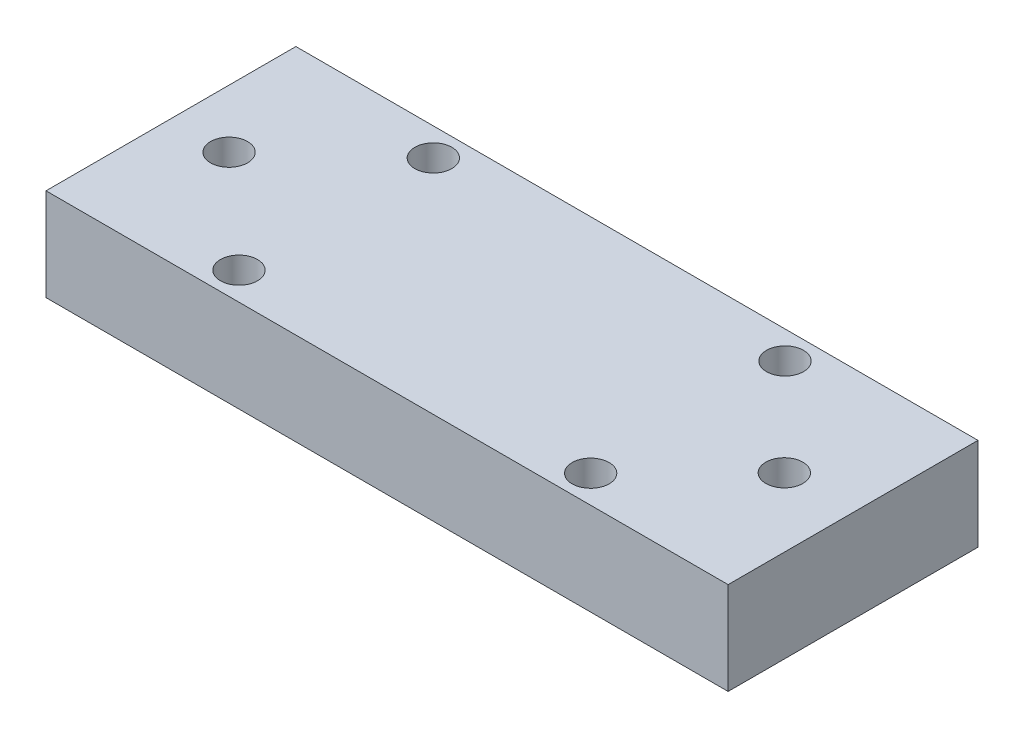
ISO-10303-21;
HEADER;
FILE_DESCRIPTION(('STEP AP214'),'2;1');
FILE_NAME('part.step','',(''),(''),'','','');
FILE_SCHEMA(('AUTOMOTIVE_DESIGN { 1 0 10303 214 1 1 1 1 }'));
ENDSEC;
DATA;
#1=APPLICATION_CONTEXT('core data for automotive mechanical design processes');
#2=APPLICATION_PROTOCOL_DEFINITION('international standard','automotive_design',2000,#1);
#3=PRODUCT_CONTEXT('',#1,'mechanical');
#4=PRODUCT('Part','Part','',(#3));
#5=PRODUCT_RELATED_PRODUCT_CATEGORY('part','',(#4));
#6=PRODUCT_DEFINITION_FORMATION('','',#4);
#7=PRODUCT_DEFINITION_CONTEXT('part definition',#1,'design');
#8=PRODUCT_DEFINITION('design','',#6,#7);
#9=PRODUCT_DEFINITION_SHAPE('','',#8);
#10=(LENGTH_UNIT() NAMED_UNIT(*) SI_UNIT(.MILLI.,.METRE.));
#11=(NAMED_UNIT(*) PLANE_ANGLE_UNIT() SI_UNIT($,.RADIAN.));
#12=(NAMED_UNIT(*) SI_UNIT($,.STERADIAN.) SOLID_ANGLE_UNIT());
#13=UNCERTAINTY_MEASURE_WITH_UNIT(LENGTH_MEASURE(1.E-05),#10,'distance_accuracy_value','');
#14=(GEOMETRIC_REPRESENTATION_CONTEXT(3) GLOBAL_UNCERTAINTY_ASSIGNED_CONTEXT((#13)) GLOBAL_UNIT_ASSIGNED_CONTEXT((#10,
#11,#12)) REPRESENTATION_CONTEXT('',''));
#15=CARTESIAN_POINT('',(0.,0.,0.));
#16=DIRECTION('',(0.,0.,1.));
#17=DIRECTION('',(1.,0.,0.));
#18=AXIS2_PLACEMENT_3D('',#15,#16,#17);
#19=CARTESIAN_POINT('',(0.,5.,0.));
#20=DIRECTION('',(0.,-1.,0.));
#21=DIRECTION('',(0.,0.,-1.));
#22=AXIS2_PLACEMENT_3D('',#19,#20,#21);
#23=PLANE('',#22);
#24=DIRECTION('',(-1.,0.,0.));
#25=VECTOR('',#24,1.);
#26=CARTESIAN_POINT('',(18.4264122816911,5.,-6.75));
#27=LINE('',#26,#25);
#28=CARTESIAN_POINT('',(18.4264122816911,5.,-6.75));
#29=VERTEX_POINT('',#28);
#30=CARTESIAN_POINT('',(-18.4264122816911,5.,-6.75));
#31=VERTEX_POINT('',#30);
#32=EDGE_CURVE('E167',#29,#31,#27,.T.);
#33=ORIENTED_EDGE('',*,*,#32,.T.);
#34=DIRECTION('',(0.,0.,-1.));
#35=VECTOR('',#34,1.);
#36=CARTESIAN_POINT('',(-18.4264122816911,5.,6.75));
#37=LINE('',#36,#35);
#38=CARTESIAN_POINT('',(-18.4264122816911,5.,6.75));
#39=VERTEX_POINT('',#38);
#40=EDGE_CURVE('E174',#39,#31,#37,.T.);
#41=ORIENTED_EDGE('',*,*,#40,.F.);
#42=DIRECTION('',(-1.,0.,0.));
#43=VECTOR('',#42,1.);
#44=CARTESIAN_POINT('',(18.4264122816911,5.,6.74999999999999));
#45=LINE('',#44,#43);
#46=CARTESIAN_POINT('',(18.4264122816911,5.,6.74999999999999));
#47=VERTEX_POINT('',#46);
#48=EDGE_CURVE('E182',#47,#39,#45,.T.);
#49=ORIENTED_EDGE('',*,*,#48,.F.);
#50=DIRECTION('',(0.,0.,-1.));
#51=VECTOR('',#50,1.);
#52=CARTESIAN_POINT('',(18.4264122816911,5.,6.74999999999999));
#53=LINE('',#52,#51);
#54=EDGE_CURVE('E144',#47,#29,#53,.T.);
#55=ORIENTED_EDGE('',*,*,#54,.T.);
#56=EDGE_LOOP('',(#33,#41,#49,#55));
#57=FACE_BOUND('',#56,.T.);
#58=CARTESIAN_POINT('',(-15.2864849599533,5.,0.));
#59=DIRECTION('',(0.,1.,0.));
#60=DIRECTION('',(0.,0.,1.));
#61=AXIS2_PLACEMENT_3D('',#58,#59,#60);
#62=CIRCLE('',#61,1.);
#63=CARTESIAN_POINT('',(-15.2864849599533,5.,1.));
#64=VERTEX_POINT('',#63);
#65=EDGE_CURVE('E193',#64,#64,#62,.T.);
#66=ORIENTED_EDGE('',*,*,#65,.F.);
#67=EDGE_LOOP('',(#66));
#68=FACE_BOUND('',#67,.T.);
#69=CARTESIAN_POINT('',(-9.5,5.,5.25));
#70=DIRECTION('',(0.,1.,0.));
#71=DIRECTION('',(0.,0.,1.));
#72=AXIS2_PLACEMENT_3D('',#69,#70,#71);
#73=CIRCLE('',#72,1.);
#74=CARTESIAN_POINT('',(-9.5,5.,6.25));
#75=VERTEX_POINT('',#74);
#76=EDGE_CURVE('E240',#75,#75,#73,.T.);
#77=ORIENTED_EDGE('',*,*,#76,.F.);
#78=EDGE_LOOP('',(#77));
#79=FACE_BOUND('',#78,.T.);
#80=CARTESIAN_POINT('',(-9.5,5.,-5.25));
#81=DIRECTION('',(0.,1.,0.));
#82=DIRECTION('',(0.,0.,1.));
#83=AXIS2_PLACEMENT_3D('',#80,#81,#82);
#84=CIRCLE('',#83,1.);
#85=CARTESIAN_POINT('',(-9.5,5.,-4.25));
#86=VERTEX_POINT('',#85);
#87=EDGE_CURVE('E235',#86,#86,#84,.T.);
#88=ORIENTED_EDGE('',*,*,#87,.F.);
#89=EDGE_LOOP('',(#88));
#90=FACE_BOUND('',#89,.T.);
#91=CARTESIAN_POINT('',(14.7135150400467,5.,0.));
#92=DIRECTION('',(0.,1.,0.));
#93=DIRECTION('',(0.,0.,1.));
#94=AXIS2_PLACEMENT_3D('',#91,#92,#93);
#95=CIRCLE('',#94,1.);
#96=CARTESIAN_POINT('',(14.7135150400467,5.,1.));
#97=VERTEX_POINT('',#96);
#98=EDGE_CURVE('E230',#97,#97,#95,.T.);
#99=ORIENTED_EDGE('',*,*,#98,.F.);
#100=EDGE_LOOP('',(#99));
#101=FACE_BOUND('',#100,.T.);
#102=CARTESIAN_POINT('',(9.5,5.,5.25));
#103=DIRECTION('',(0.,1.,0.));
#104=DIRECTION('',(0.,0.,1.));
#105=AXIS2_PLACEMENT_3D('',#102,#103,#104);
#106=CIRCLE('',#105,1.);
#107=CARTESIAN_POINT('',(9.5,5.,6.25));
#108=VERTEX_POINT('',#107);
#109=EDGE_CURVE('E225',#108,#108,#106,.T.);
#110=ORIENTED_EDGE('',*,*,#109,.F.);
#111=EDGE_LOOP('',(#110));
#112=FACE_BOUND('',#111,.T.);
#113=CARTESIAN_POINT('',(9.5,5.,-5.25));
#114=DIRECTION('',(0.,1.,0.));
#115=DIRECTION('',(0.,0.,1.));
#116=AXIS2_PLACEMENT_3D('',#113,#114,#115);
#117=CIRCLE('',#116,1.);
#118=CARTESIAN_POINT('',(9.5,5.,-4.25));
#119=VERTEX_POINT('',#118);
#120=EDGE_CURVE('E219',#119,#119,#117,.T.);
#121=ORIENTED_EDGE('',*,*,#120,.F.);
#122=EDGE_LOOP('',(#121));
#123=FACE_BOUND('',#122,.T.);
#124=ADVANCED_FACE('F127',(#57,#68,#79,#90,#101,#112,#123),#23,.F.);
#125=CARTESIAN_POINT('',(0.,0.,0.));
#126=DIRECTION('',(0.,-1.,0.));
#127=DIRECTION('',(0.,0.,-1.));
#128=AXIS2_PLACEMENT_3D('',#125,#126,#127);
#129=PLANE('',#128);
#130=CARTESIAN_POINT('',(9.5,0.,5.25));
#131=DIRECTION('',(0.,1.,0.));
#132=DIRECTION('',(0.,0.,1.));
#133=AXIS2_PLACEMENT_3D('',#130,#131,#132);
#134=CIRCLE('',#133,1.);
#135=CARTESIAN_POINT('',(9.5,0.,6.25));
#136=VERTEX_POINT('',#135);
#137=EDGE_CURVE('E222',#136,#136,#134,.T.);
#138=ORIENTED_EDGE('',*,*,#137,.T.);
#139=EDGE_LOOP('',(#138));
#140=FACE_BOUND('',#139,.T.);
#141=CARTESIAN_POINT('',(-9.5,0.,-5.25));
#142=DIRECTION('',(0.,1.,0.));
#143=DIRECTION('',(0.,0.,1.));
#144=AXIS2_PLACEMENT_3D('',#141,#142,#143);
#145=CIRCLE('',#144,1.);
#146=CARTESIAN_POINT('',(-9.5,0.,-4.25));
#147=VERTEX_POINT('',#146);
#148=EDGE_CURVE('E233',#147,#147,#145,.T.);
#149=ORIENTED_EDGE('',*,*,#148,.T.);
#150=EDGE_LOOP('',(#149));
#151=FACE_BOUND('',#150,.T.);
#152=CARTESIAN_POINT('',(-15.2864849599533,0.,0.));
#153=DIRECTION('',(0.,1.,0.));
#154=DIRECTION('',(0.,0.,1.));
#155=AXIS2_PLACEMENT_3D('',#152,#153,#154);
#156=CIRCLE('',#155,1.);
#157=CARTESIAN_POINT('',(-15.2864849599533,0.,1.));
#158=VERTEX_POINT('',#157);
#159=EDGE_CURVE('E243',#158,#158,#156,.T.);
#160=ORIENTED_EDGE('',*,*,#159,.T.);
#161=EDGE_LOOP('',(#160));
#162=FACE_BOUND('',#161,.T.);
#163=DIRECTION('',(-1.,0.,0.));
#164=VECTOR('',#163,1.);
#165=CARTESIAN_POINT('',(18.4264122816911,0.,-6.75));
#166=LINE('',#165,#164);
#167=CARTESIAN_POINT('',(18.4264122816911,0.,-6.75));
#168=VERTEX_POINT('',#167);
#169=CARTESIAN_POINT('',(-18.4264122816911,0.,-6.75));
#170=VERTEX_POINT('',#169);
#171=EDGE_CURVE('E190',#168,#170,#166,.T.);
#172=ORIENTED_EDGE('',*,*,#171,.F.);
#173=DIRECTION('',(0.,0.,-1.));
#174=VECTOR('',#173,1.);
#175=CARTESIAN_POINT('',(18.4264122816911,0.,6.74999999999999));
#176=LINE('',#175,#174);
#177=CARTESIAN_POINT('',(18.4264122816911,0.,6.74999999999999));
#178=VERTEX_POINT('',#177);
#179=EDGE_CURVE('E162',#178,#168,#176,.T.);
#180=ORIENTED_EDGE('',*,*,#179,.F.);
#181=DIRECTION('',(-1.,0.,0.));
#182=VECTOR('',#181,1.);
#183=CARTESIAN_POINT('',(18.4264122816911,0.,6.74999999999999));
#184=LINE('',#183,#182);
#185=CARTESIAN_POINT('',(-18.4264122816911,0.,6.75));
#186=VERTEX_POINT('',#185);
#187=EDGE_CURVE('E195',#178,#186,#184,.T.);
#188=ORIENTED_EDGE('',*,*,#187,.T.);
#189=DIRECTION('',(0.,0.,-1.));
#190=VECTOR('',#189,1.);
#191=CARTESIAN_POINT('',(-18.4264122816911,0.,6.75));
#192=LINE('',#191,#190);
#193=EDGE_CURVE('E176',#186,#170,#192,.T.);
#194=ORIENTED_EDGE('',*,*,#193,.T.);
#195=EDGE_LOOP('',(#172,#180,#188,#194));
#196=FACE_BOUND('',#195,.T.);
#197=CARTESIAN_POINT('',(-9.5,0.,5.25));
#198=DIRECTION('',(0.,1.,0.));
#199=DIRECTION('',(0.,0.,1.));
#200=AXIS2_PLACEMENT_3D('',#197,#198,#199);
#201=CIRCLE('',#200,1.);
#202=CARTESIAN_POINT('',(-9.5,0.,6.25));
#203=VERTEX_POINT('',#202);
#204=EDGE_CURVE('E210',#203,#203,#201,.T.);
#205=ORIENTED_EDGE('',*,*,#204,.T.);
#206=EDGE_LOOP('',(#205));
#207=FACE_BOUND('',#206,.T.);
#208=CARTESIAN_POINT('',(14.7135150400467,0.,0.));
#209=DIRECTION('',(0.,1.,0.));
#210=DIRECTION('',(0.,0.,1.));
#211=AXIS2_PLACEMENT_3D('',#208,#209,#210);
#212=CIRCLE('',#211,1.);
#213=CARTESIAN_POINT('',(14.7135150400467,0.,1.));
#214=VERTEX_POINT('',#213);
#215=EDGE_CURVE('E214',#214,#214,#212,.T.);
#216=ORIENTED_EDGE('',*,*,#215,.T.);
#217=EDGE_LOOP('',(#216));
#218=FACE_BOUND('',#217,.T.);
#219=CARTESIAN_POINT('',(9.5,0.,-5.25));
#220=DIRECTION('',(0.,1.,0.));
#221=DIRECTION('',(0.,0.,1.));
#222=AXIS2_PLACEMENT_3D('',#219,#220,#221);
#223=CIRCLE('',#222,1.);
#224=CARTESIAN_POINT('',(9.5,0.,-4.25));
#225=VERTEX_POINT('',#224);
#226=EDGE_CURVE('E217',#225,#225,#223,.T.);
#227=ORIENTED_EDGE('',*,*,#226,.T.);
#228=EDGE_LOOP('',(#227));
#229=FACE_BOUND('',#228,.T.);
#230=ADVANCED_FACE('F202',(#140,#151,#162,#196,#207,#218,#229),#129,.T.);
#231=CARTESIAN_POINT('',(18.4264122816911,5.,-6.75));
#232=DIRECTION('',(0.,0.,1.));
#233=DIRECTION('',(1.,0.,0.));
#234=AXIS2_PLACEMENT_3D('',#231,#232,#233);
#235=PLANE('',#234);
#236=ORIENTED_EDGE('',*,*,#171,.T.);
#237=DIRECTION('',(0.,-1.,0.));
#238=VECTOR('',#237,1.);
#239=CARTESIAN_POINT('',(-18.4264122816911,5.,-6.75));
#240=LINE('',#239,#238);
#241=EDGE_CURVE('E12',#31,#170,#240,.T.);
#242=ORIENTED_EDGE('',*,*,#241,.F.);
#243=ORIENTED_EDGE('',*,*,#32,.F.);
#244=DIRECTION('',(0.,-1.,0.));
#245=VECTOR('',#244,1.);
#246=CARTESIAN_POINT('',(18.4264122816911,5.,-6.75));
#247=LINE('',#246,#245);
#248=EDGE_CURVE('E186',#29,#168,#247,.T.);
#249=ORIENTED_EDGE('',*,*,#248,.T.);
#250=EDGE_LOOP('',(#236,#242,#243,#249));
#251=FACE_BOUND('',#250,.T.);
#252=ADVANCED_FACE('F129',(#251),#235,.F.);
#253=CARTESIAN_POINT('',(-18.4264122816911,5.,6.75));
#254=DIRECTION('',(-1.,0.,0.));
#255=DIRECTION('',(0.,0.,1.));
#256=AXIS2_PLACEMENT_3D('',#253,#254,#255);
#257=PLANE('',#256);
#258=ORIENTED_EDGE('',*,*,#193,.F.);
#259=DIRECTION('',(0.,-1.,0.));
#260=VECTOR('',#259,1.);
#261=CARTESIAN_POINT('',(-18.4264122816911,5.,6.75));
#262=LINE('',#261,#260);
#263=EDGE_CURVE('E136',#39,#186,#262,.T.);
#264=ORIENTED_EDGE('',*,*,#263,.F.);
#265=ORIENTED_EDGE('',*,*,#40,.T.);
#266=ORIENTED_EDGE('',*,*,#241,.T.);
#267=EDGE_LOOP('',(#258,#264,#265,#266));
#268=FACE_BOUND('',#267,.T.);
#269=ADVANCED_FACE('F173',(#268),#257,.T.);
#270=CARTESIAN_POINT('',(18.4264122816911,5.,6.74999999999999));
#271=DIRECTION('',(0.,0.,1.));
#272=DIRECTION('',(1.,0.,0.));
#273=AXIS2_PLACEMENT_3D('',#270,#271,#272);
#274=PLANE('',#273);
#275=ORIENTED_EDGE('',*,*,#187,.F.);
#276=DIRECTION('',(0.,-1.,0.));
#277=VECTOR('',#276,1.);
#278=CARTESIAN_POINT('',(18.4264122816911,5.,6.74999999999999));
#279=LINE('',#278,#277);
#280=EDGE_CURVE('E159',#47,#178,#279,.T.);
#281=ORIENTED_EDGE('',*,*,#280,.F.);
#282=ORIENTED_EDGE('',*,*,#48,.T.);
#283=ORIENTED_EDGE('',*,*,#263,.T.);
#284=EDGE_LOOP('',(#275,#281,#282,#283));
#285=FACE_BOUND('',#284,.T.);
#286=ADVANCED_FACE('F184',(#285),#274,.T.);
#287=CARTESIAN_POINT('',(18.4264122816911,5.,6.74999999999999));
#288=DIRECTION('',(-1.,0.,0.));
#289=DIRECTION('',(0.,0.,1.));
#290=AXIS2_PLACEMENT_3D('',#287,#288,#289);
#291=PLANE('',#290);
#292=ORIENTED_EDGE('',*,*,#179,.T.);
#293=ORIENTED_EDGE('',*,*,#248,.F.);
#294=ORIENTED_EDGE('',*,*,#54,.F.);
#295=ORIENTED_EDGE('',*,*,#280,.T.);
#296=EDGE_LOOP('',(#292,#293,#294,#295));
#297=FACE_BOUND('',#296,.T.);
#298=ADVANCED_FACE('F254',(#297),#291,.F.);
#299=CARTESIAN_POINT('',(-15.2864849599533,5.,0.));
#300=DIRECTION('',(0.,-1.,0.));
#301=DIRECTION('',(0.,0.,-1.));
#302=AXIS2_PLACEMENT_3D('',#299,#300,#301);
#303=CYLINDRICAL_SURFACE('',#302,1.);
#304=ORIENTED_EDGE('',*,*,#65,.T.);
#305=EDGE_LOOP('',(#304));
#306=FACE_BOUND('',#305,.T.);
#307=ORIENTED_EDGE('',*,*,#159,.F.);
#308=EDGE_LOOP('',(#307));
#309=FACE_BOUND('',#308,.T.);
#310=ADVANCED_FACE('F251',(#306,#309),#303,.F.);
#311=CARTESIAN_POINT('',(-9.5,5.,5.25));
#312=DIRECTION('',(0.,-1.,0.));
#313=DIRECTION('',(0.,0.,-1.));
#314=AXIS2_PLACEMENT_3D('',#311,#312,#313);
#315=CYLINDRICAL_SURFACE('',#314,1.);
#316=ORIENTED_EDGE('',*,*,#76,.T.);
#317=EDGE_LOOP('',(#316));
#318=FACE_BOUND('',#317,.T.);
#319=ORIENTED_EDGE('',*,*,#204,.F.);
#320=EDGE_LOOP('',(#319));
#321=FACE_BOUND('',#320,.T.);
#322=ADVANCED_FACE('F253',(#318,#321),#315,.F.);
#323=CARTESIAN_POINT('',(-9.5,5.,-5.25));
#324=DIRECTION('',(0.,-1.,0.));
#325=DIRECTION('',(0.,0.,-1.));
#326=AXIS2_PLACEMENT_3D('',#323,#324,#325);
#327=CYLINDRICAL_SURFACE('',#326,1.);
#328=ORIENTED_EDGE('',*,*,#87,.T.);
#329=EDGE_LOOP('',(#328));
#330=FACE_BOUND('',#329,.T.);
#331=ORIENTED_EDGE('',*,*,#148,.F.);
#332=EDGE_LOOP('',(#331));
#333=FACE_BOUND('',#332,.T.);
#334=ADVANCED_FACE('F261',(#330,#333),#327,.F.);
#335=CARTESIAN_POINT('',(14.7135150400467,5.,0.));
#336=DIRECTION('',(0.,-1.,0.));
#337=DIRECTION('',(0.,0.,-1.));
#338=AXIS2_PLACEMENT_3D('',#335,#336,#337);
#339=CYLINDRICAL_SURFACE('',#338,1.);
#340=ORIENTED_EDGE('',*,*,#98,.T.);
#341=EDGE_LOOP('',(#340));
#342=FACE_BOUND('',#341,.T.);
#343=ORIENTED_EDGE('',*,*,#215,.F.);
#344=EDGE_LOOP('',(#343));
#345=FACE_BOUND('',#344,.T.);
#346=ADVANCED_FACE('F320',(#342,#345),#339,.F.);
#347=CARTESIAN_POINT('',(9.5,5.,5.25));
#348=DIRECTION('',(0.,-1.,0.));
#349=DIRECTION('',(0.,0.,-1.));
#350=AXIS2_PLACEMENT_3D('',#347,#348,#349);
#351=CYLINDRICAL_SURFACE('',#350,1.);
#352=ORIENTED_EDGE('',*,*,#109,.T.);
#353=EDGE_LOOP('',(#352));
#354=FACE_BOUND('',#353,.T.);
#355=ORIENTED_EDGE('',*,*,#137,.F.);
#356=EDGE_LOOP('',(#355));
#357=FACE_BOUND('',#356,.T.);
#358=ADVANCED_FACE('F329',(#354,#357),#351,.F.);
#359=CARTESIAN_POINT('',(9.5,5.,-5.25));
#360=DIRECTION('',(0.,-1.,0.));
#361=DIRECTION('',(0.,0.,-1.));
#362=AXIS2_PLACEMENT_3D('',#359,#360,#361);
#363=CYLINDRICAL_SURFACE('',#362,1.);
#364=ORIENTED_EDGE('',*,*,#120,.T.);
#365=EDGE_LOOP('',(#364));
#366=FACE_BOUND('',#365,.T.);
#367=ORIENTED_EDGE('',*,*,#226,.F.);
#368=EDGE_LOOP('',(#367));
#369=FACE_BOUND('',#368,.T.);
#370=ADVANCED_FACE('F338',(#366,#369),#363,.F.);
#371=CLOSED_SHELL('',(#124,#230,#252,#269,#286,#298,#310,#322,#334,#346,#358,#370));
#372=MANIFOLD_SOLID_BREP('B2',#371);
#373=ADVANCED_BREP_SHAPE_REPRESENTATION('',(#18,#372),#14);
#374=SHAPE_DEFINITION_REPRESENTATION(#9,#373);
ENDSEC;
END-ISO-10303-21;
